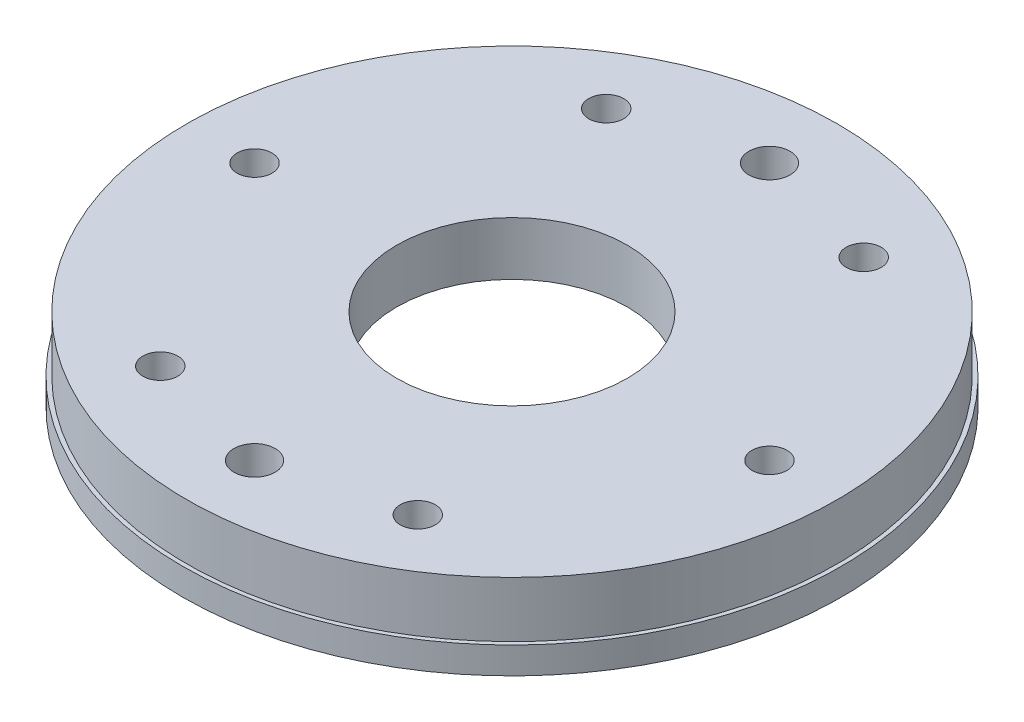
ISO-10303-21;
HEADER;
FILE_DESCRIPTION(('STEP AP214'),'2;1');
FILE_NAME('part.step','',(''),(''),'','','');
FILE_SCHEMA(('AUTOMOTIVE_DESIGN { 1 0 10303 214 1 1 1 1 }'));
ENDSEC;
DATA;
#1=APPLICATION_CONTEXT('core data for automotive mechanical design processes');
#2=APPLICATION_PROTOCOL_DEFINITION('international standard','automotive_design',2000,#1);
#3=PRODUCT_CONTEXT('',#1,'mechanical');
#4=PRODUCT('Part','Part','',(#3));
#5=PRODUCT_RELATED_PRODUCT_CATEGORY('part','',(#4));
#6=PRODUCT_DEFINITION_FORMATION('','',#4);
#7=PRODUCT_DEFINITION_CONTEXT('part definition',#1,'design');
#8=PRODUCT_DEFINITION('design','',#6,#7);
#9=PRODUCT_DEFINITION_SHAPE('','',#8);
#10=(LENGTH_UNIT() NAMED_UNIT(*) SI_UNIT(.MILLI.,.METRE.));
#11=(NAMED_UNIT(*) PLANE_ANGLE_UNIT() SI_UNIT($,.RADIAN.));
#12=(NAMED_UNIT(*) SI_UNIT($,.STERADIAN.) SOLID_ANGLE_UNIT());
#13=UNCERTAINTY_MEASURE_WITH_UNIT(LENGTH_MEASURE(1.E-05),#10,'distance_accuracy_value','');
#14=(GEOMETRIC_REPRESENTATION_CONTEXT(3) GLOBAL_UNCERTAINTY_ASSIGNED_CONTEXT((#13)) GLOBAL_UNIT_ASSIGNED_CONTEXT((#10,
#11,#12)) REPRESENTATION_CONTEXT('',''));
#15=CARTESIAN_POINT('',(0.,0.,0.));
#16=DIRECTION('',(0.,0.,1.));
#17=DIRECTION('',(1.,0.,0.));
#18=AXIS2_PLACEMENT_3D('',#15,#16,#17);
#19=CARTESIAN_POINT('',(0.,20.,0.));
#20=DIRECTION('',(0.,-1.,0.));
#21=DIRECTION('',(0.,0.,-1.));
#22=AXIS2_PLACEMENT_3D('',#19,#20,#21);
#23=CYLINDRICAL_SURFACE('',#22,28.);
#24=CARTESIAN_POINT('',(0.,20.,0.));
#25=DIRECTION('',(0.,-1.,0.));
#26=DIRECTION('',(0.,0.,-1.));
#27=AXIS2_PLACEMENT_3D('',#24,#25,#26);
#28=CIRCLE('',#27,28.);
#29=CARTESIAN_POINT('',(0.,20.,-28.));
#30=VERTEX_POINT('',#29);
#31=EDGE_CURVE('E50',#30,#30,#28,.T.);
#32=ORIENTED_EDGE('',*,*,#31,.F.);
#33=EDGE_LOOP('',(#32));
#34=FACE_BOUND('',#33,.T.);
#35=CARTESIAN_POINT('',(0.,7.,0.));
#36=DIRECTION('',(0.,-1.,0.));
#37=DIRECTION('',(0.,0.,-1.));
#38=AXIS2_PLACEMENT_3D('',#35,#36,#37);
#39=CIRCLE('',#38,28.);
#40=CARTESIAN_POINT('',(0.,7.,-28.));
#41=VERTEX_POINT('',#40);
#42=EDGE_CURVE('E36',#41,#41,#39,.F.);
#43=ORIENTED_EDGE('',*,*,#42,.F.);
#44=EDGE_LOOP('',(#43));
#45=FACE_BOUND('',#44,.T.);
#46=ADVANCED_FACE('F32',(#34,#45),#23,.F.);
#47=CARTESIAN_POINT('',(0.,0.,0.));
#48=DIRECTION('',(0.,-1.,0.));
#49=DIRECTION('',(0.,0.,-1.));
#50=AXIS2_PLACEMENT_3D('',#47,#48,#49);
#51=PLANE('',#50);
#52=CARTESIAN_POINT('',(0.,0.,0.));
#53=DIRECTION('',(0.,-1.,0.));
#54=DIRECTION('',(0.,0.,-1.));
#55=AXIS2_PLACEMENT_3D('',#52,#53,#54);
#56=CIRCLE('',#55,40.);
#57=CARTESIAN_POINT('',(0.,0.,-40.));
#58=VERTEX_POINT('',#57);
#59=EDGE_CURVE('E147',#58,#58,#56,.T.);
#60=ORIENTED_EDGE('',*,*,#59,.F.);
#61=EDGE_LOOP('',(#60));
#62=FACE_BOUND('',#61,.T.);
#63=CARTESIAN_POINT('',(0.,0.,-62.5));
#64=DIRECTION('',(0.,-1.,0.));
#65=DIRECTION('',(0.,0.,-1.));
#66=AXIS2_PLACEMENT_3D('',#63,#64,#65);
#67=CIRCLE('',#66,5.);
#68=CARTESIAN_POINT('',(0.,0.,-67.5));
#69=VERTEX_POINT('',#68);
#70=EDGE_CURVE('E143',#69,#69,#67,.T.);
#71=ORIENTED_EDGE('',*,*,#70,.F.);
#72=EDGE_LOOP('',(#71));
#73=FACE_BOUND('',#72,.T.);
#74=CARTESIAN_POINT('',(0.,0.,62.5));
#75=DIRECTION('',(0.,-1.,0.));
#76=DIRECTION('',(0.,0.,-1.));
#77=AXIS2_PLACEMENT_3D('',#74,#75,#76);
#78=CIRCLE('',#77,5.);
#79=CARTESIAN_POINT('',(0.,0.,57.5));
#80=VERTEX_POINT('',#79);
#81=EDGE_CURVE('E154',#80,#80,#78,.T.);
#82=ORIENTED_EDGE('',*,*,#81,.F.);
#83=EDGE_LOOP('',(#82));
#84=FACE_BOUND('',#83,.T.);
#85=CARTESIAN_POINT('',(31.2500000000006,0.,-54.126587736527));
#86=DIRECTION('',(0.,-1.,0.));
#87=DIRECTION('',(-0.866025403784433,0.,-0.50000000000001));
#88=AXIS2_PLACEMENT_3D('',#85,#86,#87);
#89=CIRCLE('',#88,4.24999999999999);
#90=CARTESIAN_POINT('',(27.5693920339168,0.,-56.2515877365271));
#91=VERTEX_POINT('',#90);
#92=EDGE_CURVE('E163',#91,#91,#89,.T.);
#93=ORIENTED_EDGE('',*,*,#92,.F.);
#94=EDGE_LOOP('',(#93));
#95=FACE_BOUND('',#94,.T.);
#96=CARTESIAN_POINT('',(-31.2499999999995,0.,-54.1265877365277));
#97=DIRECTION('',(0.,-1.,0.));
#98=DIRECTION('',(-0.866025403784443,0.,0.499999999999992));
#99=AXIS2_PLACEMENT_3D('',#96,#97,#98);
#100=CIRCLE('',#99,4.24999999999999);
#101=CARTESIAN_POINT('',(-34.9306079660834,0.,-52.0015877365277));
#102=VERTEX_POINT('',#101);
#103=EDGE_CURVE('E169',#102,#102,#100,.T.);
#104=ORIENTED_EDGE('',*,*,#103,.F.);
#105=EDGE_LOOP('',(#104));
#106=FACE_BOUND('',#105,.T.);
#107=CARTESIAN_POINT('',(-62.5,0.,-4.36435420138673E-13));
#108=DIRECTION('',(0.,-1.,0.));
#109=DIRECTION('',(0.,0.,1.));
#110=AXIS2_PLACEMENT_3D('',#107,#108,#109);
#111=CIRCLE('',#110,4.24999999999999);
#112=CARTESIAN_POINT('',(-62.5,0.,4.24999999999955));
#113=VERTEX_POINT('',#112);
#114=EDGE_CURVE('E175',#113,#113,#111,.T.);
#115=ORIENTED_EDGE('',*,*,#114,.F.);
#116=EDGE_LOOP('',(#115));
#117=FACE_BOUND('',#116,.T.);
#118=CARTESIAN_POINT('',(-31.2500000000003,0.,54.1265877365273));
#119=DIRECTION('',(0.,-1.,0.));
#120=DIRECTION('',(0.866025403784436,0.,0.500000000000004));
#121=AXIS2_PLACEMENT_3D('',#118,#119,#120);
#122=CIRCLE('',#121,4.24999999999999);
#123=CARTESIAN_POINT('',(-27.5693920339164,0.,56.2515877365273));
#124=VERTEX_POINT('',#123);
#125=EDGE_CURVE('E181',#124,#124,#122,.T.);
#126=ORIENTED_EDGE('',*,*,#125,.F.);
#127=EDGE_LOOP('',(#126));
#128=FACE_BOUND('',#127,.T.);
#129=CARTESIAN_POINT('',(31.2499999999999,0.,54.1265877365275));
#130=DIRECTION('',(0.,-1.,0.));
#131=DIRECTION('',(0.86602540378444,0.,-0.499999999999998));
#132=AXIS2_PLACEMENT_3D('',#129,#130,#131);
#133=CIRCLE('',#132,4.24999999999999);
#134=CARTESIAN_POINT('',(34.9306079660837,0.,52.0015877365275));
#135=VERTEX_POINT('',#134);
#136=EDGE_CURVE('E58',#135,#135,#133,.T.);
#137=ORIENTED_EDGE('',*,*,#136,.F.);
#138=EDGE_LOOP('',(#137));
#139=FACE_BOUND('',#138,.T.);
#140=CARTESIAN_POINT('',(62.5,0.,0.));
#141=DIRECTION('',(0.,-1.,0.));
#142=DIRECTION('',(0.,0.,-1.));
#143=AXIS2_PLACEMENT_3D('',#140,#141,#142);
#144=CIRCLE('',#143,4.24999999999999);
#145=CARTESIAN_POINT('',(62.5,0.,-4.24999999999999));
#146=VERTEX_POINT('',#145);
#147=EDGE_CURVE('E51',#146,#146,#144,.T.);
#148=ORIENTED_EDGE('',*,*,#147,.F.);
#149=EDGE_LOOP('',(#148));
#150=FACE_BOUND('',#149,.T.);
#151=CARTESIAN_POINT('',(0.,0.,0.));
#152=DIRECTION('',(0.,-1.,0.));
#153=DIRECTION('',(0.,0.,-1.));
#154=AXIS2_PLACEMENT_3D('',#151,#152,#153);
#155=CIRCLE('',#154,80.);
#156=CARTESIAN_POINT('',(0.,0.,-80.));
#157=VERTEX_POINT('',#156);
#158=EDGE_CURVE('E10',#157,#157,#155,.T.);
#159=ORIENTED_EDGE('',*,*,#158,.T.);
#160=EDGE_LOOP('',(#159));
#161=FACE_BOUND('',#160,.T.);
#162=ADVANCED_FACE('F34',(#62,#73,#84,#95,#106,#117,#128,#139,#150,#161),#51,.T.);
#163=CARTESIAN_POINT('',(0.,0.,0.));
#164=DIRECTION('',(0.,-1.,0.));
#165=DIRECTION('',(0.,0.,-1.));
#166=AXIS2_PLACEMENT_3D('',#163,#164,#165);
#167=CYLINDRICAL_SURFACE('',#166,80.);
#168=CARTESIAN_POINT('',(0.,6.5,0.));
#169=DIRECTION('',(0.,-1.,0.));
#170=DIRECTION('',(0.,0.,-1.));
#171=AXIS2_PLACEMENT_3D('',#168,#169,#170);
#172=CIRCLE('',#171,80.);
#173=CARTESIAN_POINT('',(0.,6.5,-80.));
#174=VERTEX_POINT('',#173);
#175=EDGE_CURVE('E40',#174,#174,#172,.T.);
#176=ORIENTED_EDGE('',*,*,#175,.T.);
#177=EDGE_LOOP('',(#176));
#178=FACE_BOUND('',#177,.T.);
#179=ORIENTED_EDGE('',*,*,#158,.F.);
#180=EDGE_LOOP('',(#179));
#181=FACE_BOUND('',#180,.T.);
#182=ADVANCED_FACE('F86',(#178,#181),#167,.T.);
#183=CARTESIAN_POINT('',(80.,6.5,0.));
#184=DIRECTION('',(0.,1.,0.));
#185=DIRECTION('',(0.,0.,1.));
#186=AXIS2_PLACEMENT_3D('',#183,#184,#185);
#187=PLANE('',#186);
#188=CARTESIAN_POINT('',(0.,6.5,0.));
#189=DIRECTION('',(0.,-1.,0.));
#190=DIRECTION('',(0.,0.,-1.));
#191=AXIS2_PLACEMENT_3D('',#188,#189,#190);
#192=CIRCLE('',#191,79.);
#193=CARTESIAN_POINT('',(0.,6.5,-79.));
#194=VERTEX_POINT('',#193);
#195=EDGE_CURVE('E45',#194,#194,#192,.T.);
#196=ORIENTED_EDGE('',*,*,#195,.T.);
#197=EDGE_LOOP('',(#196));
#198=FACE_BOUND('',#197,.T.);
#199=ORIENTED_EDGE('',*,*,#175,.F.);
#200=EDGE_LOOP('',(#199));
#201=FACE_BOUND('',#200,.T.);
#202=ADVANCED_FACE('F71',(#198,#201),#187,.T.);
#203=CARTESIAN_POINT('',(0.,0.,0.));
#204=DIRECTION('',(0.,-1.,0.));
#205=DIRECTION('',(0.,0.,-1.));
#206=AXIS2_PLACEMENT_3D('',#203,#204,#205);
#207=CYLINDRICAL_SURFACE('',#206,79.);
#208=CARTESIAN_POINT('',(0.,20.,0.));
#209=DIRECTION('',(0.,-1.,0.));
#210=DIRECTION('',(0.,0.,-1.));
#211=AXIS2_PLACEMENT_3D('',#208,#209,#210);
#212=CIRCLE('',#211,79.);
#213=CARTESIAN_POINT('',(0.,20.,-79.));
#214=VERTEX_POINT('',#213);
#215=EDGE_CURVE('E55',#214,#214,#212,.T.);
#216=ORIENTED_EDGE('',*,*,#215,.T.);
#217=EDGE_LOOP('',(#216));
#218=FACE_BOUND('',#217,.T.);
#219=ORIENTED_EDGE('',*,*,#195,.F.);
#220=EDGE_LOOP('',(#219));
#221=FACE_BOUND('',#220,.T.);
#222=ADVANCED_FACE('F74',(#218,#221),#207,.T.);
#223=CARTESIAN_POINT('',(79.,20.,0.));
#224=DIRECTION('',(0.,1.,0.));
#225=DIRECTION('',(0.,0.,1.));
#226=AXIS2_PLACEMENT_3D('',#223,#224,#225);
#227=PLANE('',#226);
#228=CARTESIAN_POINT('',(0.,20.,-62.5));
#229=DIRECTION('',(0.,-1.,0.));
#230=DIRECTION('',(0.,0.,-1.));
#231=AXIS2_PLACEMENT_3D('',#228,#229,#230);
#232=CIRCLE('',#231,5.);
#233=CARTESIAN_POINT('',(0.,20.,-67.5));
#234=VERTEX_POINT('',#233);
#235=EDGE_CURVE('E145',#234,#234,#232,.T.);
#236=ORIENTED_EDGE('',*,*,#235,.T.);
#237=EDGE_LOOP('',(#236));
#238=FACE_BOUND('',#237,.T.);
#239=CARTESIAN_POINT('',(0.,20.,62.5));
#240=DIRECTION('',(0.,-1.,0.));
#241=DIRECTION('',(0.,0.,-1.));
#242=AXIS2_PLACEMENT_3D('',#239,#240,#241);
#243=CIRCLE('',#242,5.);
#244=CARTESIAN_POINT('',(0.,20.,57.5));
#245=VERTEX_POINT('',#244);
#246=EDGE_CURVE('E157',#245,#245,#243,.T.);
#247=ORIENTED_EDGE('',*,*,#246,.T.);
#248=EDGE_LOOP('',(#247));
#249=FACE_BOUND('',#248,.T.);
#250=CARTESIAN_POINT('',(31.2500000000006,20.,-54.126587736527));
#251=DIRECTION('',(0.,1.,0.));
#252=DIRECTION('',(0.866025403784433,0.,0.50000000000001));
#253=AXIS2_PLACEMENT_3D('',#250,#251,#252);
#254=CIRCLE('',#253,4.24999999999999);
#255=CARTESIAN_POINT('',(34.9306079660845,20.,-52.001587736527));
#256=VERTEX_POINT('',#255);
#257=EDGE_CURVE('E160',#256,#256,#254,.T.);
#258=ORIENTED_EDGE('',*,*,#257,.F.);
#259=EDGE_LOOP('',(#258));
#260=FACE_BOUND('',#259,.T.);
#261=CARTESIAN_POINT('',(-31.2499999999995,20.,-54.1265877365277));
#262=DIRECTION('',(0.,1.,0.));
#263=DIRECTION('',(0.866025403784443,0.,-0.499999999999992));
#264=AXIS2_PLACEMENT_3D('',#261,#262,#263);
#265=CIRCLE('',#264,4.24999999999999);
#266=CARTESIAN_POINT('',(-27.5693920339156,20.,-56.2515877365277));
#267=VERTEX_POINT('',#266);
#268=EDGE_CURVE('E166',#267,#267,#265,.T.);
#269=ORIENTED_EDGE('',*,*,#268,.F.);
#270=EDGE_LOOP('',(#269));
#271=FACE_BOUND('',#270,.T.);
#272=CARTESIAN_POINT('',(-62.5,20.,-4.36435420138673E-13));
#273=DIRECTION('',(0.,1.,0.));
#274=DIRECTION('',(0.,0.,-1.));
#275=AXIS2_PLACEMENT_3D('',#272,#273,#274);
#276=CIRCLE('',#275,4.24999999999999);
#277=CARTESIAN_POINT('',(-62.5,20.,-4.25000000000043));
#278=VERTEX_POINT('',#277);
#279=EDGE_CURVE('E172',#278,#278,#276,.T.);
#280=ORIENTED_EDGE('',*,*,#279,.F.);
#281=EDGE_LOOP('',(#280));
#282=FACE_BOUND('',#281,.T.);
#283=CARTESIAN_POINT('',(-31.2500000000003,20.,54.1265877365273));
#284=DIRECTION('',(0.,1.,0.));
#285=DIRECTION('',(-0.866025403784436,0.,-0.500000000000004));
#286=AXIS2_PLACEMENT_3D('',#283,#284,#285);
#287=CIRCLE('',#286,4.24999999999999);
#288=CARTESIAN_POINT('',(-34.9306079660841,20.,52.0015877365273));
#289=VERTEX_POINT('',#288);
#290=EDGE_CURVE('E178',#289,#289,#287,.T.);
#291=ORIENTED_EDGE('',*,*,#290,.F.);
#292=EDGE_LOOP('',(#291));
#293=FACE_BOUND('',#292,.T.);
#294=CARTESIAN_POINT('',(31.2499999999999,20.,54.1265877365275));
#295=DIRECTION('',(0.,1.,0.));
#296=DIRECTION('',(-0.86602540378444,0.,0.499999999999998));
#297=AXIS2_PLACEMENT_3D('',#294,#295,#296);
#298=CIRCLE('',#297,4.24999999999999);
#299=CARTESIAN_POINT('',(27.569392033916,20.,56.2515877365275));
#300=VERTEX_POINT('',#299);
#301=EDGE_CURVE('E63',#300,#300,#298,.T.);
#302=ORIENTED_EDGE('',*,*,#301,.F.);
#303=EDGE_LOOP('',(#302));
#304=FACE_BOUND('',#303,.T.);
#305=CARTESIAN_POINT('',(62.5,20.,0.));
#306=DIRECTION('',(0.,1.,0.));
#307=DIRECTION('',(0.,0.,1.));
#308=AXIS2_PLACEMENT_3D('',#305,#306,#307);
#309=CIRCLE('',#308,4.24999999999999);
#310=CARTESIAN_POINT('',(62.5,20.,4.24999999999999));
#311=VERTEX_POINT('',#310);
#312=EDGE_CURVE('E48',#311,#311,#309,.T.);
#313=ORIENTED_EDGE('',*,*,#312,.F.);
#314=EDGE_LOOP('',(#313));
#315=FACE_BOUND('',#314,.T.);
#316=ORIENTED_EDGE('',*,*,#31,.T.);
#317=EDGE_LOOP('',(#316));
#318=FACE_BOUND('',#317,.T.);
#319=ORIENTED_EDGE('',*,*,#215,.F.);
#320=EDGE_LOOP('',(#319));
#321=FACE_BOUND('',#320,.T.);
#322=ADVANCED_FACE('F76',(#238,#249,#260,#271,#282,#293,#304,#315,#318,#321),#227,.T.);
#323=CARTESIAN_POINT('',(62.5,0.,0.));
#324=DIRECTION('',(0.,-1.,0.));
#325=DIRECTION('',(0.,0.,-1.));
#326=AXIS2_PLACEMENT_3D('',#323,#324,#325);
#327=CYLINDRICAL_SURFACE('',#326,4.24999999999999);
#328=ORIENTED_EDGE('',*,*,#312,.T.);
#329=EDGE_LOOP('',(#328));
#330=FACE_BOUND('',#329,.T.);
#331=ORIENTED_EDGE('',*,*,#147,.T.);
#332=EDGE_LOOP('',(#331));
#333=FACE_BOUND('',#332,.T.);
#334=ADVANCED_FACE('F83',(#330,#333),#327,.F.);
#335=CARTESIAN_POINT('',(31.2499999999999,0.,54.1265877365275));
#336=DIRECTION('',(0.,-1.,0.));
#337=DIRECTION('',(0.86602540378444,0.,-0.499999999999998));
#338=AXIS2_PLACEMENT_3D('',#335,#336,#337);
#339=CYLINDRICAL_SURFACE('',#338,4.24999999999999);
#340=ORIENTED_EDGE('',*,*,#301,.T.);
#341=EDGE_LOOP('',(#340));
#342=FACE_BOUND('',#341,.T.);
#343=ORIENTED_EDGE('',*,*,#136,.T.);
#344=EDGE_LOOP('',(#343));
#345=FACE_BOUND('',#344,.T.);
#346=ADVANCED_FACE('F100',(#342,#345),#339,.F.);
#347=CARTESIAN_POINT('',(-31.2500000000003,0.,54.1265877365273));
#348=DIRECTION('',(0.,-1.,0.));
#349=DIRECTION('',(0.866025403784436,0.,0.500000000000004));
#350=AXIS2_PLACEMENT_3D('',#347,#348,#349);
#351=CYLINDRICAL_SURFACE('',#350,4.24999999999999);
#352=ORIENTED_EDGE('',*,*,#290,.T.);
#353=EDGE_LOOP('',(#352));
#354=FACE_BOUND('',#353,.T.);
#355=ORIENTED_EDGE('',*,*,#125,.T.);
#356=EDGE_LOOP('',(#355));
#357=FACE_BOUND('',#356,.T.);
#358=ADVANCED_FACE('F103',(#354,#357),#351,.F.);
#359=CARTESIAN_POINT('',(-62.5,0.,-4.36435420138673E-13));
#360=DIRECTION('',(0.,-1.,0.));
#361=DIRECTION('',(0.,0.,1.));
#362=AXIS2_PLACEMENT_3D('',#359,#360,#361);
#363=CYLINDRICAL_SURFACE('',#362,4.24999999999999);
#364=ORIENTED_EDGE('',*,*,#279,.T.);
#365=EDGE_LOOP('',(#364));
#366=FACE_BOUND('',#365,.T.);
#367=ORIENTED_EDGE('',*,*,#114,.T.);
#368=EDGE_LOOP('',(#367));
#369=FACE_BOUND('',#368,.T.);
#370=ADVANCED_FACE('F107',(#366,#369),#363,.F.);
#371=CARTESIAN_POINT('',(-31.2499999999995,0.,-54.1265877365277));
#372=DIRECTION('',(0.,-1.,0.));
#373=DIRECTION('',(-0.866025403784443,0.,0.499999999999992));
#374=AXIS2_PLACEMENT_3D('',#371,#372,#373);
#375=CYLINDRICAL_SURFACE('',#374,4.24999999999999);
#376=ORIENTED_EDGE('',*,*,#268,.T.);
#377=EDGE_LOOP('',(#376));
#378=FACE_BOUND('',#377,.T.);
#379=ORIENTED_EDGE('',*,*,#103,.T.);
#380=EDGE_LOOP('',(#379));
#381=FACE_BOUND('',#380,.T.);
#382=ADVANCED_FACE('F111',(#378,#381),#375,.F.);
#383=CARTESIAN_POINT('',(31.2500000000006,0.,-54.126587736527));
#384=DIRECTION('',(0.,-1.,0.));
#385=DIRECTION('',(-0.866025403784433,0.,-0.50000000000001));
#386=AXIS2_PLACEMENT_3D('',#383,#384,#385);
#387=CYLINDRICAL_SURFACE('',#386,4.24999999999999);
#388=ORIENTED_EDGE('',*,*,#257,.T.);
#389=EDGE_LOOP('',(#388));
#390=FACE_BOUND('',#389,.T.);
#391=ORIENTED_EDGE('',*,*,#92,.T.);
#392=EDGE_LOOP('',(#391));
#393=FACE_BOUND('',#392,.T.);
#394=ADVANCED_FACE('F115',(#390,#393),#387,.F.);
#395=CARTESIAN_POINT('',(0.,20.,62.5));
#396=DIRECTION('',(0.,-1.,0.));
#397=DIRECTION('',(0.,0.,-1.));
#398=AXIS2_PLACEMENT_3D('',#395,#396,#397);
#399=CYLINDRICAL_SURFACE('',#398,5.);
#400=ORIENTED_EDGE('',*,*,#246,.F.);
#401=EDGE_LOOP('',(#400));
#402=FACE_BOUND('',#401,.T.);
#403=ORIENTED_EDGE('',*,*,#81,.T.);
#404=EDGE_LOOP('',(#403));
#405=FACE_BOUND('',#404,.T.);
#406=ADVANCED_FACE('F119',(#402,#405),#399,.F.);
#407=CARTESIAN_POINT('',(0.,20.,-62.5));
#408=DIRECTION('',(0.,-1.,0.));
#409=DIRECTION('',(0.,0.,-1.));
#410=AXIS2_PLACEMENT_3D('',#407,#408,#409);
#411=CYLINDRICAL_SURFACE('',#410,5.);
#412=ORIENTED_EDGE('',*,*,#235,.F.);
#413=EDGE_LOOP('',(#412));
#414=FACE_BOUND('',#413,.T.);
#415=ORIENTED_EDGE('',*,*,#70,.T.);
#416=EDGE_LOOP('',(#415));
#417=FACE_BOUND('',#416,.T.);
#418=ADVANCED_FACE('F123',(#414,#417),#411,.F.);
#419=CARTESIAN_POINT('',(0.,7.,0.));
#420=DIRECTION('',(0.,-1.,0.));
#421=DIRECTION('',(0.,0.,-1.));
#422=AXIS2_PLACEMENT_3D('',#419,#420,#421);
#423=PLANE('',#422);
#424=CARTESIAN_POINT('',(0.,7.,0.));
#425=DIRECTION('',(0.,-1.,0.));
#426=DIRECTION('',(0.,0.,-1.));
#427=AXIS2_PLACEMENT_3D('',#424,#425,#426);
#428=CIRCLE('',#427,40.);
#429=CARTESIAN_POINT('',(0.,7.,-40.));
#430=VERTEX_POINT('',#429);
#431=EDGE_CURVE('E140',#430,#430,#428,.T.);
#432=ORIENTED_EDGE('',*,*,#431,.T.);
#433=EDGE_LOOP('',(#432));
#434=FACE_BOUND('',#433,.T.);
#435=ORIENTED_EDGE('',*,*,#42,.T.);
#436=EDGE_LOOP('',(#435));
#437=FACE_BOUND('',#436,.T.);
#438=ADVANCED_FACE('F127',(#434,#437),#423,.T.);
#439=CARTESIAN_POINT('',(0.,7.,0.));
#440=DIRECTION('',(0.,-1.,0.));
#441=DIRECTION('',(0.,0.,-1.));
#442=AXIS2_PLACEMENT_3D('',#439,#440,#441);
#443=CYLINDRICAL_SURFACE('',#442,40.);
#444=ORIENTED_EDGE('',*,*,#431,.F.);
#445=EDGE_LOOP('',(#444));
#446=FACE_BOUND('',#445,.T.);
#447=ORIENTED_EDGE('',*,*,#59,.T.);
#448=EDGE_LOOP('',(#447));
#449=FACE_BOUND('',#448,.T.);
#450=ADVANCED_FACE('F129',(#446,#449),#443,.F.);
#451=CLOSED_SHELL('',(#46,#162,#182,#202,#222,#322,#334,#346,#358,#370,#382,#394,#406,#418,#438,#450));
#452=MANIFOLD_SOLID_BREP('B2',#451);
#453=ADVANCED_BREP_SHAPE_REPRESENTATION('',(#18,#452),#14);
#454=SHAPE_DEFINITION_REPRESENTATION(#9,#453);
ENDSEC;
END-ISO-10303-21;
